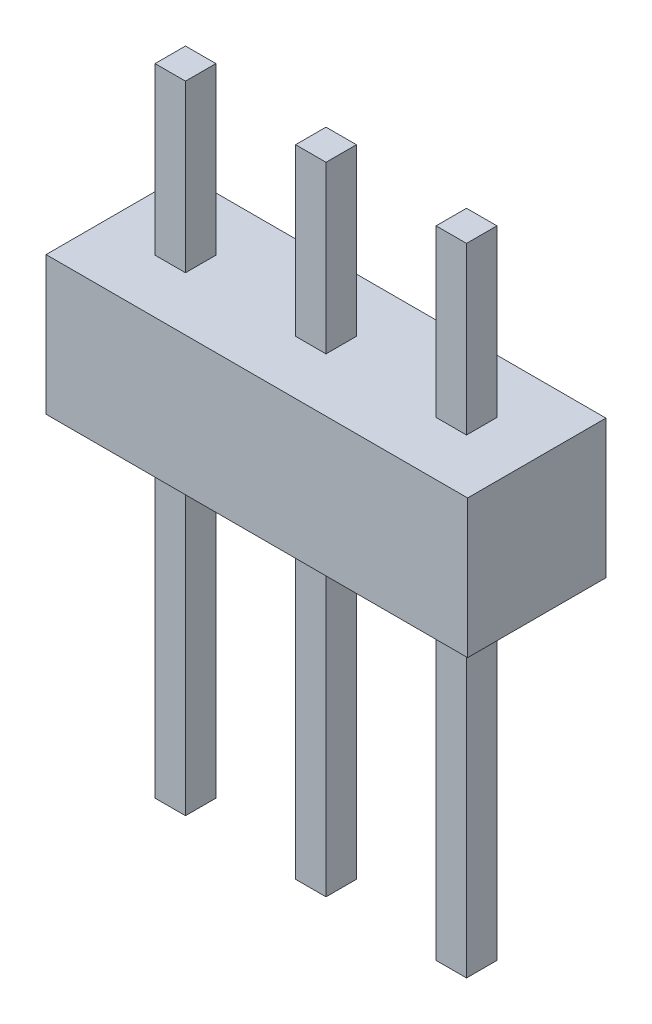
ISO-10303-21;
HEADER;
FILE_DESCRIPTION(('STEP AP214'),'2;1');
FILE_NAME('part.step','',(''),(''),'','','');
FILE_SCHEMA(('AUTOMOTIVE_DESIGN { 1 0 10303 214 1 1 1 1 }'));
ENDSEC;
DATA;
#1=APPLICATION_CONTEXT('core data for automotive mechanical design processes');
#2=APPLICATION_PROTOCOL_DEFINITION('international standard','automotive_design',2000,#1);
#3=PRODUCT_CONTEXT('',#1,'mechanical');
#4=PRODUCT('Part','Part','',(#3));
#5=PRODUCT_RELATED_PRODUCT_CATEGORY('part','',(#4));
#6=PRODUCT_DEFINITION_FORMATION('','',#4);
#7=PRODUCT_DEFINITION_CONTEXT('part definition',#1,'design');
#8=PRODUCT_DEFINITION('design','',#6,#7);
#9=PRODUCT_DEFINITION_SHAPE('','',#8);
#10=(LENGTH_UNIT() NAMED_UNIT(*) SI_UNIT(.MILLI.,.METRE.));
#11=(NAMED_UNIT(*) PLANE_ANGLE_UNIT() SI_UNIT($,.RADIAN.));
#12=(NAMED_UNIT(*) SI_UNIT($,.STERADIAN.) SOLID_ANGLE_UNIT());
#13=UNCERTAINTY_MEASURE_WITH_UNIT(LENGTH_MEASURE(1.E-05),#10,'distance_accuracy_value','');
#14=(GEOMETRIC_REPRESENTATION_CONTEXT(3) GLOBAL_UNCERTAINTY_ASSIGNED_CONTEXT((#13)) GLOBAL_UNIT_ASSIGNED_CONTEXT((#10,
#11,#12)) REPRESENTATION_CONTEXT('',''));
#15=CARTESIAN_POINT('',(0.,0.,0.));
#16=DIRECTION('',(0.,0.,1.));
#17=DIRECTION('',(1.,0.,0.));
#18=AXIS2_PLACEMENT_3D('',#15,#16,#17);
#19=CARTESIAN_POINT('',(6.625,5.5,-0.275));
#20=DIRECTION('',(1.,0.,0.));
#21=DIRECTION('',(0.,0.,-1.));
#22=AXIS2_PLACEMENT_3D('',#19,#20,#21);
#23=PLANE('',#22);
#24=DIRECTION('',(0.,0.,1.));
#25=VECTOR('',#24,1.);
#26=CARTESIAN_POINT('',(6.625,0.,-0.275));
#27=LINE('',#26,#25);
#28=CARTESIAN_POINT('',(6.625,0.,-0.275));
#29=VERTEX_POINT('',#28);
#30=CARTESIAN_POINT('',(6.625,0.,0.275));
#31=VERTEX_POINT('',#30);
#32=EDGE_CURVE('E107',#29,#31,#27,.T.);
#33=ORIENTED_EDGE('',*,*,#32,.F.);
#34=DIRECTION('',(0.,-1.,0.));
#35=VECTOR('',#34,1.);
#36=CARTESIAN_POINT('',(6.625,5.5,-0.275));
#37=LINE('',#36,#35);
#38=CARTESIAN_POINT('',(6.625,5.5,-0.275));
#39=VERTEX_POINT('',#38);
#40=EDGE_CURVE('E12',#39,#29,#37,.T.);
#41=ORIENTED_EDGE('',*,*,#40,.F.);
#42=DIRECTION('',(0.,0.,1.));
#43=VECTOR('',#42,1.);
#44=CARTESIAN_POINT('',(6.625,5.5,-0.275));
#45=LINE('',#44,#43);
#46=CARTESIAN_POINT('',(6.625,5.5,0.275));
#47=VERTEX_POINT('',#46);
#48=EDGE_CURVE('E101',#39,#47,#45,.T.);
#49=ORIENTED_EDGE('',*,*,#48,.T.);
#50=DIRECTION('',(0.,-1.,0.));
#51=VECTOR('',#50,1.);
#52=CARTESIAN_POINT('',(6.625,5.5,0.275));
#53=LINE('',#52,#51);
#54=EDGE_CURVE('E46',#47,#31,#53,.T.);
#55=ORIENTED_EDGE('',*,*,#54,.T.);
#56=EDGE_LOOP('',(#33,#41,#49,#55));
#57=FACE_BOUND('',#56,.T.);
#58=ADVANCED_FACE('F43',(#57),#23,.T.);
#59=CARTESIAN_POINT('',(6.075,5.5,-0.275));
#60=DIRECTION('',(0.,0.,-1.));
#61=DIRECTION('',(-1.,0.,0.));
#62=AXIS2_PLACEMENT_3D('',#59,#60,#61);
#63=PLANE('',#62);
#64=DIRECTION('',(1.,0.,0.));
#65=VECTOR('',#64,1.);
#66=CARTESIAN_POINT('',(6.075,0.,-0.275));
#67=LINE('',#66,#65);
#68=CARTESIAN_POINT('',(6.075,0.,-0.275));
#69=VERTEX_POINT('',#68);
#70=EDGE_CURVE('E103',#69,#29,#67,.T.);
#71=ORIENTED_EDGE('',*,*,#70,.F.);
#72=DIRECTION('',(0.,-1.,0.));
#73=VECTOR('',#72,1.);
#74=CARTESIAN_POINT('',(6.075,5.5,-0.275));
#75=LINE('',#74,#73);
#76=CARTESIAN_POINT('',(6.075,5.5,-0.275));
#77=VERTEX_POINT('',#76);
#78=EDGE_CURVE('E52',#77,#69,#75,.T.);
#79=ORIENTED_EDGE('',*,*,#78,.F.);
#80=DIRECTION('',(1.,0.,0.));
#81=VECTOR('',#80,1.);
#82=CARTESIAN_POINT('',(6.075,5.5,-0.275));
#83=LINE('',#82,#81);
#84=EDGE_CURVE('E98',#77,#39,#83,.T.);
#85=ORIENTED_EDGE('',*,*,#84,.T.);
#86=ORIENTED_EDGE('',*,*,#40,.T.);
#87=EDGE_LOOP('',(#71,#79,#85,#86));
#88=FACE_BOUND('',#87,.T.);
#89=ADVANCED_FACE('F117',(#88),#63,.T.);
#90=CARTESIAN_POINT('',(6.075,5.5,-0.275));
#91=DIRECTION('',(-1.,0.,0.));
#92=DIRECTION('',(0.,0.,1.));
#93=AXIS2_PLACEMENT_3D('',#90,#91,#92);
#94=PLANE('',#93);
#95=DIRECTION('',(0.,0.,-1.));
#96=VECTOR('',#95,1.);
#97=CARTESIAN_POINT('',(6.075,0.,-0.275));
#98=LINE('',#97,#96);
#99=CARTESIAN_POINT('',(6.075,0.,0.275));
#100=VERTEX_POINT('',#99);
#101=EDGE_CURVE('E93',#100,#69,#98,.T.);
#102=ORIENTED_EDGE('',*,*,#101,.F.);
#103=DIRECTION('',(0.,-1.,0.));
#104=VECTOR('',#103,1.);
#105=CARTESIAN_POINT('',(6.075,5.5,0.275));
#106=LINE('',#105,#104);
#107=CARTESIAN_POINT('',(6.075,5.5,0.275));
#108=VERTEX_POINT('',#107);
#109=EDGE_CURVE('E88',#108,#100,#106,.T.);
#110=ORIENTED_EDGE('',*,*,#109,.F.);
#111=DIRECTION('',(0.,0.,-1.));
#112=VECTOR('',#111,1.);
#113=CARTESIAN_POINT('',(6.075,5.5,-0.275));
#114=LINE('',#113,#112);
#115=EDGE_CURVE('E91',#108,#77,#114,.T.);
#116=ORIENTED_EDGE('',*,*,#115,.T.);
#117=ORIENTED_EDGE('',*,*,#78,.T.);
#118=EDGE_LOOP('',(#102,#110,#116,#117));
#119=FACE_BOUND('',#118,.T.);
#120=ADVANCED_FACE('F90',(#119),#94,.T.);
#121=CARTESIAN_POINT('',(6.075,5.5,0.275));
#122=DIRECTION('',(0.,0.,1.));
#123=DIRECTION('',(1.,0.,0.));
#124=AXIS2_PLACEMENT_3D('',#121,#122,#123);
#125=PLANE('',#124);
#126=DIRECTION('',(-1.,0.,0.));
#127=VECTOR('',#126,1.);
#128=CARTESIAN_POINT('',(6.075,0.,0.275));
#129=LINE('',#128,#127);
#130=EDGE_CURVE('E110',#31,#100,#129,.T.);
#131=ORIENTED_EDGE('',*,*,#130,.F.);
#132=ORIENTED_EDGE('',*,*,#54,.F.);
#133=DIRECTION('',(-1.,0.,0.));
#134=VECTOR('',#133,1.);
#135=CARTESIAN_POINT('',(6.075,5.5,0.275));
#136=LINE('',#135,#134);
#137=EDGE_CURVE('E97',#47,#108,#136,.T.);
#138=ORIENTED_EDGE('',*,*,#137,.T.);
#139=ORIENTED_EDGE('',*,*,#109,.T.);
#140=EDGE_LOOP('',(#131,#132,#138,#139));
#141=FACE_BOUND('',#140,.T.);
#142=ADVANCED_FACE('F100',(#141),#125,.T.);
#143=CARTESIAN_POINT('',(0.,5.5,0.));
#144=DIRECTION('',(0.,1.,0.));
#145=DIRECTION('',(0.,0.,1.));
#146=AXIS2_PLACEMENT_3D('',#143,#144,#145);
#147=PLANE('',#146);
#148=ORIENTED_EDGE('',*,*,#48,.F.);
#149=ORIENTED_EDGE('',*,*,#84,.F.);
#150=ORIENTED_EDGE('',*,*,#115,.F.);
#151=ORIENTED_EDGE('',*,*,#137,.F.);
#152=EDGE_LOOP('',(#148,#149,#150,#151));
#153=FACE_BOUND('',#152,.T.);
#154=ADVANCED_FACE('F96',(#153),#147,.T.);
#155=CARTESIAN_POINT('',(0.,0.,0.));
#156=DIRECTION('',(0.,1.,0.));
#157=DIRECTION('',(0.,0.,1.));
#158=AXIS2_PLACEMENT_3D('',#155,#156,#157);
#159=PLANE('',#158);
#160=ORIENTED_EDGE('',*,*,#32,.T.);
#161=ORIENTED_EDGE('',*,*,#130,.T.);
#162=ORIENTED_EDGE('',*,*,#101,.T.);
#163=ORIENTED_EDGE('',*,*,#70,.T.);
#164=EDGE_LOOP('',(#160,#161,#162,#163));
#165=FACE_BOUND('',#164,.T.);
#166=ADVANCED_FACE('F116',(#165),#159,.F.);
#167=CLOSED_SHELL('',(#58,#89,#120,#142,#154,#166));
#168=MANIFOLD_SOLID_BREP('B2',#167);
#169=CARTESIAN_POINT('',(4.085,5.5,-0.275));
#170=DIRECTION('',(1.,0.,0.));
#171=DIRECTION('',(0.,0.,-1.));
#172=AXIS2_PLACEMENT_3D('',#169,#170,#171);
#173=PLANE('',#172);
#174=DIRECTION('',(0.,0.,1.));
#175=VECTOR('',#174,1.);
#176=CARTESIAN_POINT('',(4.085,0.,-0.275));
#177=LINE('',#176,#175);
#178=CARTESIAN_POINT('',(4.085,0.,-0.275));
#179=VERTEX_POINT('',#178);
#180=CARTESIAN_POINT('',(4.085,0.,0.275));
#181=VERTEX_POINT('',#180);
#182=EDGE_CURVE('E240',#179,#181,#177,.T.);
#183=ORIENTED_EDGE('',*,*,#182,.F.);
#184=DIRECTION('',(0.,-1.,0.));
#185=VECTOR('',#184,1.);
#186=CARTESIAN_POINT('',(4.085,5.5,-0.275));
#187=LINE('',#186,#185);
#188=CARTESIAN_POINT('',(4.085,5.5,-0.275));
#189=VERTEX_POINT('',#188);
#190=EDGE_CURVE('E41',#189,#179,#187,.T.);
#191=ORIENTED_EDGE('',*,*,#190,.F.);
#192=DIRECTION('',(0.,0.,1.));
#193=VECTOR('',#192,1.);
#194=CARTESIAN_POINT('',(4.085,5.5,-0.275));
#195=LINE('',#194,#193);
#196=CARTESIAN_POINT('',(4.085,5.5,0.275));
#197=VERTEX_POINT('',#196);
#198=EDGE_CURVE('E234',#189,#197,#195,.T.);
#199=ORIENTED_EDGE('',*,*,#198,.T.);
#200=DIRECTION('',(0.,-1.,0.));
#201=VECTOR('',#200,1.);
#202=CARTESIAN_POINT('',(4.085,5.5,0.275));
#203=LINE('',#202,#201);
#204=EDGE_CURVE('E179',#197,#181,#203,.T.);
#205=ORIENTED_EDGE('',*,*,#204,.T.);
#206=EDGE_LOOP('',(#183,#191,#199,#205));
#207=FACE_BOUND('',#206,.T.);
#208=ADVANCED_FACE('F176',(#207),#173,.T.);
#209=CARTESIAN_POINT('',(3.535,5.5,-0.275));
#210=DIRECTION('',(0.,0.,-1.));
#211=DIRECTION('',(-1.,0.,0.));
#212=AXIS2_PLACEMENT_3D('',#209,#210,#211);
#213=PLANE('',#212);
#214=DIRECTION('',(1.,0.,0.));
#215=VECTOR('',#214,1.);
#216=CARTESIAN_POINT('',(3.535,0.,-0.275));
#217=LINE('',#216,#215);
#218=CARTESIAN_POINT('',(3.535,0.,-0.275));
#219=VERTEX_POINT('',#218);
#220=EDGE_CURVE('E236',#219,#179,#217,.T.);
#221=ORIENTED_EDGE('',*,*,#220,.F.);
#222=DIRECTION('',(0.,-1.,0.));
#223=VECTOR('',#222,1.);
#224=CARTESIAN_POINT('',(3.535,5.5,-0.275));
#225=LINE('',#224,#223);
#226=CARTESIAN_POINT('',(3.535,5.5,-0.275));
#227=VERTEX_POINT('',#226);
#228=EDGE_CURVE('E185',#227,#219,#225,.T.);
#229=ORIENTED_EDGE('',*,*,#228,.F.);
#230=DIRECTION('',(1.,0.,0.));
#231=VECTOR('',#230,1.);
#232=CARTESIAN_POINT('',(3.535,5.5,-0.275));
#233=LINE('',#232,#231);
#234=EDGE_CURVE('E231',#227,#189,#233,.T.);
#235=ORIENTED_EDGE('',*,*,#234,.T.);
#236=ORIENTED_EDGE('',*,*,#190,.T.);
#237=EDGE_LOOP('',(#221,#229,#235,#236));
#238=FACE_BOUND('',#237,.T.);
#239=ADVANCED_FACE('F250',(#238),#213,.T.);
#240=CARTESIAN_POINT('',(3.535,5.5,-0.275));
#241=DIRECTION('',(-1.,0.,0.));
#242=DIRECTION('',(0.,0.,1.));
#243=AXIS2_PLACEMENT_3D('',#240,#241,#242);
#244=PLANE('',#243);
#245=DIRECTION('',(0.,0.,-1.));
#246=VECTOR('',#245,1.);
#247=CARTESIAN_POINT('',(3.535,0.,-0.275));
#248=LINE('',#247,#246);
#249=CARTESIAN_POINT('',(3.535,0.,0.275));
#250=VERTEX_POINT('',#249);
#251=EDGE_CURVE('E226',#250,#219,#248,.T.);
#252=ORIENTED_EDGE('',*,*,#251,.F.);
#253=DIRECTION('',(0.,-1.,0.));
#254=VECTOR('',#253,1.);
#255=CARTESIAN_POINT('',(3.535,5.5,0.275));
#256=LINE('',#255,#254);
#257=CARTESIAN_POINT('',(3.535,5.5,0.275));
#258=VERTEX_POINT('',#257);
#259=EDGE_CURVE('E221',#258,#250,#256,.T.);
#260=ORIENTED_EDGE('',*,*,#259,.F.);
#261=DIRECTION('',(0.,0.,-1.));
#262=VECTOR('',#261,1.);
#263=CARTESIAN_POINT('',(3.535,5.5,-0.275));
#264=LINE('',#263,#262);
#265=EDGE_CURVE('E224',#258,#227,#264,.T.);
#266=ORIENTED_EDGE('',*,*,#265,.T.);
#267=ORIENTED_EDGE('',*,*,#228,.T.);
#268=EDGE_LOOP('',(#252,#260,#266,#267));
#269=FACE_BOUND('',#268,.T.);
#270=ADVANCED_FACE('F223',(#269),#244,.T.);
#271=CARTESIAN_POINT('',(3.535,5.5,0.275));
#272=DIRECTION('',(0.,0.,1.));
#273=DIRECTION('',(1.,0.,0.));
#274=AXIS2_PLACEMENT_3D('',#271,#272,#273);
#275=PLANE('',#274);
#276=DIRECTION('',(-1.,0.,0.));
#277=VECTOR('',#276,1.);
#278=CARTESIAN_POINT('',(3.535,0.,0.275));
#279=LINE('',#278,#277);
#280=EDGE_CURVE('E243',#181,#250,#279,.T.);
#281=ORIENTED_EDGE('',*,*,#280,.F.);
#282=ORIENTED_EDGE('',*,*,#204,.F.);
#283=DIRECTION('',(-1.,0.,0.));
#284=VECTOR('',#283,1.);
#285=CARTESIAN_POINT('',(3.535,5.5,0.275));
#286=LINE('',#285,#284);
#287=EDGE_CURVE('E230',#197,#258,#286,.T.);
#288=ORIENTED_EDGE('',*,*,#287,.T.);
#289=ORIENTED_EDGE('',*,*,#259,.T.);
#290=EDGE_LOOP('',(#281,#282,#288,#289));
#291=FACE_BOUND('',#290,.T.);
#292=ADVANCED_FACE('F233',(#291),#275,.T.);
#293=CARTESIAN_POINT('',(0.,5.5,0.));
#294=DIRECTION('',(0.,1.,0.));
#295=DIRECTION('',(0.,0.,1.));
#296=AXIS2_PLACEMENT_3D('',#293,#294,#295);
#297=PLANE('',#296);
#298=ORIENTED_EDGE('',*,*,#198,.F.);
#299=ORIENTED_EDGE('',*,*,#234,.F.);
#300=ORIENTED_EDGE('',*,*,#265,.F.);
#301=ORIENTED_EDGE('',*,*,#287,.F.);
#302=EDGE_LOOP('',(#298,#299,#300,#301));
#303=FACE_BOUND('',#302,.T.);
#304=ADVANCED_FACE('F229',(#303),#297,.T.);
#305=CARTESIAN_POINT('',(0.,0.,0.));
#306=DIRECTION('',(0.,1.,0.));
#307=DIRECTION('',(0.,0.,1.));
#308=AXIS2_PLACEMENT_3D('',#305,#306,#307);
#309=PLANE('',#308);
#310=ORIENTED_EDGE('',*,*,#182,.T.);
#311=ORIENTED_EDGE('',*,*,#280,.T.);
#312=ORIENTED_EDGE('',*,*,#251,.T.);
#313=ORIENTED_EDGE('',*,*,#220,.T.);
#314=EDGE_LOOP('',(#310,#311,#312,#313));
#315=FACE_BOUND('',#314,.T.);
#316=ADVANCED_FACE('F249',(#315),#309,.F.);
#317=CLOSED_SHELL('',(#208,#239,#270,#292,#304,#316));
#318=MANIFOLD_SOLID_BREP('B6',#317);
#319=CARTESIAN_POINT('',(1.545,5.5,-0.275));
#320=DIRECTION('',(1.,0.,0.));
#321=DIRECTION('',(0.,0.,-1.));
#322=AXIS2_PLACEMENT_3D('',#319,#320,#321);
#323=PLANE('',#322);
#324=DIRECTION('',(0.,0.,1.));
#325=VECTOR('',#324,1.);
#326=CARTESIAN_POINT('',(1.545,0.,-0.275));
#327=LINE('',#326,#325);
#328=CARTESIAN_POINT('',(1.545,0.,-0.275));
#329=VERTEX_POINT('',#328);
#330=CARTESIAN_POINT('',(1.545,0.,0.275));
#331=VERTEX_POINT('',#330);
#332=EDGE_CURVE('E373',#329,#331,#327,.T.);
#333=ORIENTED_EDGE('',*,*,#332,.F.);
#334=DIRECTION('',(0.,-1.,0.));
#335=VECTOR('',#334,1.);
#336=CARTESIAN_POINT('',(1.545,5.5,-0.275));
#337=LINE('',#336,#335);
#338=CARTESIAN_POINT('',(1.545,5.5,-0.275));
#339=VERTEX_POINT('',#338);
#340=EDGE_CURVE('E174',#339,#329,#337,.T.);
#341=ORIENTED_EDGE('',*,*,#340,.F.);
#342=DIRECTION('',(0.,0.,1.));
#343=VECTOR('',#342,1.);
#344=CARTESIAN_POINT('',(1.545,5.5,-0.275));
#345=LINE('',#344,#343);
#346=CARTESIAN_POINT('',(1.545,5.5,0.275));
#347=VERTEX_POINT('',#346);
#348=EDGE_CURVE('E367',#339,#347,#345,.T.);
#349=ORIENTED_EDGE('',*,*,#348,.T.);
#350=DIRECTION('',(0.,-1.,0.));
#351=VECTOR('',#350,1.);
#352=CARTESIAN_POINT('',(1.545,5.5,0.275));
#353=LINE('',#352,#351);
#354=EDGE_CURVE('E312',#347,#331,#353,.T.);
#355=ORIENTED_EDGE('',*,*,#354,.T.);
#356=EDGE_LOOP('',(#333,#341,#349,#355));
#357=FACE_BOUND('',#356,.T.);
#358=ADVANCED_FACE('F309',(#357),#323,.T.);
#359=CARTESIAN_POINT('',(0.995,5.5,-0.275));
#360=DIRECTION('',(0.,0.,-1.));
#361=DIRECTION('',(-1.,0.,0.));
#362=AXIS2_PLACEMENT_3D('',#359,#360,#361);
#363=PLANE('',#362);
#364=DIRECTION('',(1.,0.,0.));
#365=VECTOR('',#364,1.);
#366=CARTESIAN_POINT('',(0.995,0.,-0.275));
#367=LINE('',#366,#365);
#368=CARTESIAN_POINT('',(0.995,0.,-0.275));
#369=VERTEX_POINT('',#368);
#370=EDGE_CURVE('E369',#369,#329,#367,.T.);
#371=ORIENTED_EDGE('',*,*,#370,.F.);
#372=DIRECTION('',(0.,-1.,0.));
#373=VECTOR('',#372,1.);
#374=CARTESIAN_POINT('',(0.995,5.5,-0.275));
#375=LINE('',#374,#373);
#376=CARTESIAN_POINT('',(0.995,5.5,-0.275));
#377=VERTEX_POINT('',#376);
#378=EDGE_CURVE('E318',#377,#369,#375,.T.);
#379=ORIENTED_EDGE('',*,*,#378,.F.);
#380=DIRECTION('',(1.,0.,0.));
#381=VECTOR('',#380,1.);
#382=CARTESIAN_POINT('',(0.995,5.5,-0.275));
#383=LINE('',#382,#381);
#384=EDGE_CURVE('E364',#377,#339,#383,.T.);
#385=ORIENTED_EDGE('',*,*,#384,.T.);
#386=ORIENTED_EDGE('',*,*,#340,.T.);
#387=EDGE_LOOP('',(#371,#379,#385,#386));
#388=FACE_BOUND('',#387,.T.);
#389=ADVANCED_FACE('F383',(#388),#363,.T.);
#390=CARTESIAN_POINT('',(0.995,5.5,-0.275));
#391=DIRECTION('',(-1.,0.,0.));
#392=DIRECTION('',(0.,0.,1.));
#393=AXIS2_PLACEMENT_3D('',#390,#391,#392);
#394=PLANE('',#393);
#395=DIRECTION('',(0.,0.,-1.));
#396=VECTOR('',#395,1.);
#397=CARTESIAN_POINT('',(0.995,0.,-0.275));
#398=LINE('',#397,#396);
#399=CARTESIAN_POINT('',(0.995,0.,0.275));
#400=VERTEX_POINT('',#399);
#401=EDGE_CURVE('E359',#400,#369,#398,.T.);
#402=ORIENTED_EDGE('',*,*,#401,.F.);
#403=DIRECTION('',(0.,-1.,0.));
#404=VECTOR('',#403,1.);
#405=CARTESIAN_POINT('',(0.995,5.5,0.275));
#406=LINE('',#405,#404);
#407=CARTESIAN_POINT('',(0.995,5.5,0.275));
#408=VERTEX_POINT('',#407);
#409=EDGE_CURVE('E354',#408,#400,#406,.T.);
#410=ORIENTED_EDGE('',*,*,#409,.F.);
#411=DIRECTION('',(0.,0.,-1.));
#412=VECTOR('',#411,1.);
#413=CARTESIAN_POINT('',(0.995,5.5,-0.275));
#414=LINE('',#413,#412);
#415=EDGE_CURVE('E357',#408,#377,#414,.T.);
#416=ORIENTED_EDGE('',*,*,#415,.T.);
#417=ORIENTED_EDGE('',*,*,#378,.T.);
#418=EDGE_LOOP('',(#402,#410,#416,#417));
#419=FACE_BOUND('',#418,.T.);
#420=ADVANCED_FACE('F356',(#419),#394,.T.);
#421=CARTESIAN_POINT('',(0.995,5.5,0.275));
#422=DIRECTION('',(0.,0.,1.));
#423=DIRECTION('',(1.,0.,0.));
#424=AXIS2_PLACEMENT_3D('',#421,#422,#423);
#425=PLANE('',#424);
#426=DIRECTION('',(-1.,0.,0.));
#427=VECTOR('',#426,1.);
#428=CARTESIAN_POINT('',(0.995,0.,0.275));
#429=LINE('',#428,#427);
#430=EDGE_CURVE('E376',#331,#400,#429,.T.);
#431=ORIENTED_EDGE('',*,*,#430,.F.);
#432=ORIENTED_EDGE('',*,*,#354,.F.);
#433=DIRECTION('',(-1.,0.,0.));
#434=VECTOR('',#433,1.);
#435=CARTESIAN_POINT('',(0.995,5.5,0.275));
#436=LINE('',#435,#434);
#437=EDGE_CURVE('E363',#347,#408,#436,.T.);
#438=ORIENTED_EDGE('',*,*,#437,.T.);
#439=ORIENTED_EDGE('',*,*,#409,.T.);
#440=EDGE_LOOP('',(#431,#432,#438,#439));
#441=FACE_BOUND('',#440,.T.);
#442=ADVANCED_FACE('F366',(#441),#425,.T.);
#443=CARTESIAN_POINT('',(0.,5.5,0.));
#444=DIRECTION('',(0.,1.,0.));
#445=DIRECTION('',(0.,0.,1.));
#446=AXIS2_PLACEMENT_3D('',#443,#444,#445);
#447=PLANE('',#446);
#448=ORIENTED_EDGE('',*,*,#348,.F.);
#449=ORIENTED_EDGE('',*,*,#384,.F.);
#450=ORIENTED_EDGE('',*,*,#415,.F.);
#451=ORIENTED_EDGE('',*,*,#437,.F.);
#452=EDGE_LOOP('',(#448,#449,#450,#451));
#453=FACE_BOUND('',#452,.T.);
#454=ADVANCED_FACE('F362',(#453),#447,.T.);
#455=CARTESIAN_POINT('',(0.,0.,0.));
#456=DIRECTION('',(0.,1.,0.));
#457=DIRECTION('',(0.,0.,1.));
#458=AXIS2_PLACEMENT_3D('',#455,#456,#457);
#459=PLANE('',#458);
#460=ORIENTED_EDGE('',*,*,#332,.T.);
#461=ORIENTED_EDGE('',*,*,#430,.T.);
#462=ORIENTED_EDGE('',*,*,#401,.T.);
#463=ORIENTED_EDGE('',*,*,#370,.T.);
#464=EDGE_LOOP('',(#460,#461,#462,#463));
#465=FACE_BOUND('',#464,.T.);
#466=ADVANCED_FACE('F382',(#465),#459,.F.);
#467=CLOSED_SHELL('',(#358,#389,#420,#442,#454,#466));
#468=MANIFOLD_SOLID_BREP('B35',#467);
#469=CARTESIAN_POINT('',(6.625,-6.,-0.275));
#470=DIRECTION('',(-1.,0.,0.));
#471=DIRECTION('',(0.,0.,1.));
#472=AXIS2_PLACEMENT_3D('',#469,#470,#471);
#473=PLANE('',#472);
#474=DIRECTION('',(0.,0.,1.));
#475=VECTOR('',#474,1.);
#476=CARTESIAN_POINT('',(6.625,0.,-0.275));
#477=LINE('',#476,#475);
#478=CARTESIAN_POINT('',(6.625,0.,-0.275));
#479=VERTEX_POINT('',#478);
#480=CARTESIAN_POINT('',(6.625,0.,0.275));
#481=VERTEX_POINT('',#480);
#482=EDGE_CURVE('E505',#479,#481,#477,.T.);
#483=ORIENTED_EDGE('',*,*,#482,.T.);
#484=DIRECTION('',(0.,1.,0.));
#485=VECTOR('',#484,1.);
#486=CARTESIAN_POINT('',(6.625,-6.,0.275));
#487=LINE('',#486,#485);
#488=CARTESIAN_POINT('',(6.625,-6.,0.275));
#489=VERTEX_POINT('',#488);
#490=EDGE_CURVE('E307',#489,#481,#487,.T.);
#491=ORIENTED_EDGE('',*,*,#490,.F.);
#492=DIRECTION('',(0.,0.,1.));
#493=VECTOR('',#492,1.);
#494=CARTESIAN_POINT('',(6.625,-6.,-0.275));
#495=LINE('',#494,#493);
#496=CARTESIAN_POINT('',(6.625,-6.,-0.275));
#497=VERTEX_POINT('',#496);
#498=EDGE_CURVE('E493',#497,#489,#495,.T.);
#499=ORIENTED_EDGE('',*,*,#498,.F.);
#500=DIRECTION('',(0.,1.,0.));
#501=VECTOR('',#500,1.);
#502=CARTESIAN_POINT('',(6.625,-6.,-0.275));
#503=LINE('',#502,#501);
#504=EDGE_CURVE('E501',#497,#479,#503,.T.);
#505=ORIENTED_EDGE('',*,*,#504,.T.);
#506=EDGE_LOOP('',(#483,#491,#499,#505));
#507=FACE_BOUND('',#506,.T.);
#508=ADVANCED_FACE('F442',(#507),#473,.F.);
#509=CARTESIAN_POINT('',(6.075,-6.,0.275));
#510=DIRECTION('',(0.,0.,-1.));
#511=DIRECTION('',(-1.,0.,0.));
#512=AXIS2_PLACEMENT_3D('',#509,#510,#511);
#513=PLANE('',#512);
#514=DIRECTION('',(-1.,0.,0.));
#515=VECTOR('',#514,1.);
#516=CARTESIAN_POINT('',(6.075,0.,0.275));
#517=LINE('',#516,#515);
#518=CARTESIAN_POINT('',(6.075,0.,0.275));
#519=VERTEX_POINT('',#518);
#520=EDGE_CURVE('E497',#481,#519,#517,.T.);
#521=ORIENTED_EDGE('',*,*,#520,.T.);
#522=DIRECTION('',(0.,1.,0.));
#523=VECTOR('',#522,1.);
#524=CARTESIAN_POINT('',(6.075,-6.,0.275));
#525=LINE('',#524,#523);
#526=CARTESIAN_POINT('',(6.075,-6.,0.275));
#527=VERTEX_POINT('',#526);
#528=EDGE_CURVE('E450',#527,#519,#525,.T.);
#529=ORIENTED_EDGE('',*,*,#528,.F.);
#530=DIRECTION('',(-1.,0.,0.));
#531=VECTOR('',#530,1.);
#532=CARTESIAN_POINT('',(6.075,-6.,0.275));
#533=LINE('',#532,#531);
#534=EDGE_CURVE('E488',#489,#527,#533,.T.);
#535=ORIENTED_EDGE('',*,*,#534,.F.);
#536=ORIENTED_EDGE('',*,*,#490,.T.);
#537=EDGE_LOOP('',(#521,#529,#535,#536));
#538=FACE_BOUND('',#537,.T.);
#539=ADVANCED_FACE('F496',(#538),#513,.F.);
#540=CARTESIAN_POINT('',(6.075,-6.,-0.275));
#541=DIRECTION('',(1.,0.,0.));
#542=DIRECTION('',(0.,0.,-1.));
#543=AXIS2_PLACEMENT_3D('',#540,#541,#542);
#544=PLANE('',#543);
#545=DIRECTION('',(0.,0.,-1.));
#546=VECTOR('',#545,1.);
#547=CARTESIAN_POINT('',(6.075,0.,-0.275));
#548=LINE('',#547,#546);
#549=CARTESIAN_POINT('',(6.075,0.,-0.275));
#550=VERTEX_POINT('',#549);
#551=EDGE_CURVE('E475',#519,#550,#548,.T.);
#552=ORIENTED_EDGE('',*,*,#551,.T.);
#553=DIRECTION('',(0.,1.,0.));
#554=VECTOR('',#553,1.);
#555=CARTESIAN_POINT('',(6.075,-6.,-0.275));
#556=LINE('',#555,#554);
#557=CARTESIAN_POINT('',(6.075,-6.,-0.275));
#558=VERTEX_POINT('',#557);
#559=EDGE_CURVE('E498',#558,#550,#556,.T.);
#560=ORIENTED_EDGE('',*,*,#559,.F.);
#561=DIRECTION('',(0.,0.,-1.));
#562=VECTOR('',#561,1.);
#563=CARTESIAN_POINT('',(6.075,-6.,-0.275));
#564=LINE('',#563,#562);
#565=EDGE_CURVE('E491',#527,#558,#564,.T.);
#566=ORIENTED_EDGE('',*,*,#565,.F.);
#567=ORIENTED_EDGE('',*,*,#528,.T.);
#568=EDGE_LOOP('',(#552,#560,#566,#567));
#569=FACE_BOUND('',#568,.T.);
#570=ADVANCED_FACE('F499',(#569),#544,.F.);
#571=CARTESIAN_POINT('',(6.075,-6.,-0.275));
#572=DIRECTION('',(0.,0.,1.));
#573=DIRECTION('',(1.,0.,0.));
#574=AXIS2_PLACEMENT_3D('',#571,#572,#573);
#575=PLANE('',#574);
#576=DIRECTION('',(1.,0.,0.));
#577=VECTOR('',#576,1.);
#578=CARTESIAN_POINT('',(6.075,0.,-0.275));
#579=LINE('',#578,#577);
#580=EDGE_CURVE('E481',#550,#479,#579,.T.);
#581=ORIENTED_EDGE('',*,*,#580,.T.);
#582=ORIENTED_EDGE('',*,*,#504,.F.);
#583=DIRECTION('',(1.,0.,0.));
#584=VECTOR('',#583,1.);
#585=CARTESIAN_POINT('',(6.075,-6.,-0.275));
#586=LINE('',#585,#584);
#587=EDGE_CURVE('E458',#558,#497,#586,.T.);
#588=ORIENTED_EDGE('',*,*,#587,.F.);
#589=ORIENTED_EDGE('',*,*,#559,.T.);
#590=EDGE_LOOP('',(#581,#582,#588,#589));
#591=FACE_BOUND('',#590,.T.);
#592=ADVANCED_FACE('F512',(#591),#575,.F.);
#593=CARTESIAN_POINT('',(0.,-6.,0.));
#594=DIRECTION('',(0.,1.,0.));
#595=DIRECTION('',(0.,0.,1.));
#596=AXIS2_PLACEMENT_3D('',#593,#594,#595);
#597=PLANE('',#596);
#598=ORIENTED_EDGE('',*,*,#498,.T.);
#599=ORIENTED_EDGE('',*,*,#534,.T.);
#600=ORIENTED_EDGE('',*,*,#565,.T.);
#601=ORIENTED_EDGE('',*,*,#587,.T.);
#602=EDGE_LOOP('',(#598,#599,#600,#601));
#603=FACE_BOUND('',#602,.T.);
#604=ADVANCED_FACE('F489',(#603),#597,.F.);
#605=CARTESIAN_POINT('',(0.,0.,0.));
#606=DIRECTION('',(0.,1.,0.));
#607=DIRECTION('',(0.,0.,1.));
#608=AXIS2_PLACEMENT_3D('',#605,#606,#607);
#609=PLANE('',#608);
#610=ORIENTED_EDGE('',*,*,#482,.F.);
#611=ORIENTED_EDGE('',*,*,#580,.F.);
#612=ORIENTED_EDGE('',*,*,#551,.F.);
#613=ORIENTED_EDGE('',*,*,#520,.F.);
#614=EDGE_LOOP('',(#610,#611,#612,#613));
#615=FACE_BOUND('',#614,.T.);
#616=ADVANCED_FACE('F515',(#615),#609,.T.);
#617=CLOSED_SHELL('',(#508,#539,#570,#592,#604,#616));
#618=MANIFOLD_SOLID_BREP('B168',#617);
#619=CARTESIAN_POINT('',(4.085,-6.,-0.275));
#620=DIRECTION('',(-1.,0.,0.));
#621=DIRECTION('',(0.,0.,1.));
#622=AXIS2_PLACEMENT_3D('',#619,#620,#621);
#623=PLANE('',#622);
#624=DIRECTION('',(0.,0.,1.));
#625=VECTOR('',#624,1.);
#626=CARTESIAN_POINT('',(4.085,0.,-0.275));
#627=LINE('',#626,#625);
#628=CARTESIAN_POINT('',(4.085,0.,-0.275));
#629=VERTEX_POINT('',#628);
#630=CARTESIAN_POINT('',(4.085,0.,0.275));
#631=VERTEX_POINT('',#630);
#632=EDGE_CURVE('E638',#629,#631,#627,.T.);
#633=ORIENTED_EDGE('',*,*,#632,.T.);
#634=DIRECTION('',(0.,1.,0.));
#635=VECTOR('',#634,1.);
#636=CARTESIAN_POINT('',(4.085,-6.,0.275));
#637=LINE('',#636,#635);
#638=CARTESIAN_POINT('',(4.085,-6.,0.275));
#639=VERTEX_POINT('',#638);
#640=EDGE_CURVE('E440',#639,#631,#637,.T.);
#641=ORIENTED_EDGE('',*,*,#640,.F.);
#642=DIRECTION('',(0.,0.,1.));
#643=VECTOR('',#642,1.);
#644=CARTESIAN_POINT('',(4.085,-6.,-0.275));
#645=LINE('',#644,#643);
#646=CARTESIAN_POINT('',(4.085,-6.,-0.275));
#647=VERTEX_POINT('',#646);
#648=EDGE_CURVE('E626',#647,#639,#645,.T.);
#649=ORIENTED_EDGE('',*,*,#648,.F.);
#650=DIRECTION('',(0.,1.,0.));
#651=VECTOR('',#650,1.);
#652=CARTESIAN_POINT('',(4.085,-6.,-0.275));
#653=LINE('',#652,#651);
#654=EDGE_CURVE('E634',#647,#629,#653,.T.);
#655=ORIENTED_EDGE('',*,*,#654,.T.);
#656=EDGE_LOOP('',(#633,#641,#649,#655));
#657=FACE_BOUND('',#656,.T.);
#658=ADVANCED_FACE('F575',(#657),#623,.F.);
#659=CARTESIAN_POINT('',(3.535,-6.,0.275));
#660=DIRECTION('',(0.,0.,-1.));
#661=DIRECTION('',(-1.,0.,0.));
#662=AXIS2_PLACEMENT_3D('',#659,#660,#661);
#663=PLANE('',#662);
#664=DIRECTION('',(-1.,0.,0.));
#665=VECTOR('',#664,1.);
#666=CARTESIAN_POINT('',(3.535,0.,0.275));
#667=LINE('',#666,#665);
#668=CARTESIAN_POINT('',(3.535,0.,0.275));
#669=VERTEX_POINT('',#668);
#670=EDGE_CURVE('E630',#631,#669,#667,.T.);
#671=ORIENTED_EDGE('',*,*,#670,.T.);
#672=DIRECTION('',(0.,1.,0.));
#673=VECTOR('',#672,1.);
#674=CARTESIAN_POINT('',(3.535,-6.,0.275));
#675=LINE('',#674,#673);
#676=CARTESIAN_POINT('',(3.535,-6.,0.275));
#677=VERTEX_POINT('',#676);
#678=EDGE_CURVE('E583',#677,#669,#675,.T.);
#679=ORIENTED_EDGE('',*,*,#678,.F.);
#680=DIRECTION('',(-1.,0.,0.));
#681=VECTOR('',#680,1.);
#682=CARTESIAN_POINT('',(3.535,-6.,0.275));
#683=LINE('',#682,#681);
#684=EDGE_CURVE('E621',#639,#677,#683,.T.);
#685=ORIENTED_EDGE('',*,*,#684,.F.);
#686=ORIENTED_EDGE('',*,*,#640,.T.);
#687=EDGE_LOOP('',(#671,#679,#685,#686));
#688=FACE_BOUND('',#687,.T.);
#689=ADVANCED_FACE('F629',(#688),#663,.F.);
#690=CARTESIAN_POINT('',(3.535,-6.,-0.275));
#691=DIRECTION('',(1.,0.,0.));
#692=DIRECTION('',(0.,0.,-1.));
#693=AXIS2_PLACEMENT_3D('',#690,#691,#692);
#694=PLANE('',#693);
#695=DIRECTION('',(0.,0.,-1.));
#696=VECTOR('',#695,1.);
#697=CARTESIAN_POINT('',(3.535,0.,-0.275));
#698=LINE('',#697,#696);
#699=CARTESIAN_POINT('',(3.535,0.,-0.275));
#700=VERTEX_POINT('',#699);
#701=EDGE_CURVE('E608',#669,#700,#698,.T.);
#702=ORIENTED_EDGE('',*,*,#701,.T.);
#703=DIRECTION('',(0.,1.,0.));
#704=VECTOR('',#703,1.);
#705=CARTESIAN_POINT('',(3.535,-6.,-0.275));
#706=LINE('',#705,#704);
#707=CARTESIAN_POINT('',(3.535,-6.,-0.275));
#708=VERTEX_POINT('',#707);
#709=EDGE_CURVE('E631',#708,#700,#706,.T.);
#710=ORIENTED_EDGE('',*,*,#709,.F.);
#711=DIRECTION('',(0.,0.,-1.));
#712=VECTOR('',#711,1.);
#713=CARTESIAN_POINT('',(3.535,-6.,-0.275));
#714=LINE('',#713,#712);
#715=EDGE_CURVE('E624',#677,#708,#714,.T.);
#716=ORIENTED_EDGE('',*,*,#715,.F.);
#717=ORIENTED_EDGE('',*,*,#678,.T.);
#718=EDGE_LOOP('',(#702,#710,#716,#717));
#719=FACE_BOUND('',#718,.T.);
#720=ADVANCED_FACE('F632',(#719),#694,.F.);
#721=CARTESIAN_POINT('',(3.535,-6.,-0.275));
#722=DIRECTION('',(0.,0.,1.));
#723=DIRECTION('',(1.,0.,0.));
#724=AXIS2_PLACEMENT_3D('',#721,#722,#723);
#725=PLANE('',#724);
#726=DIRECTION('',(1.,0.,0.));
#727=VECTOR('',#726,1.);
#728=CARTESIAN_POINT('',(3.535,0.,-0.275));
#729=LINE('',#728,#727);
#730=EDGE_CURVE('E614',#700,#629,#729,.T.);
#731=ORIENTED_EDGE('',*,*,#730,.T.);
#732=ORIENTED_EDGE('',*,*,#654,.F.);
#733=DIRECTION('',(1.,0.,0.));
#734=VECTOR('',#733,1.);
#735=CARTESIAN_POINT('',(3.535,-6.,-0.275));
#736=LINE('',#735,#734);
#737=EDGE_CURVE('E591',#708,#647,#736,.T.);
#738=ORIENTED_EDGE('',*,*,#737,.F.);
#739=ORIENTED_EDGE('',*,*,#709,.T.);
#740=EDGE_LOOP('',(#731,#732,#738,#739));
#741=FACE_BOUND('',#740,.T.);
#742=ADVANCED_FACE('F645',(#741),#725,.F.);
#743=CARTESIAN_POINT('',(0.,-6.,0.));
#744=DIRECTION('',(0.,1.,0.));
#745=DIRECTION('',(0.,0.,1.));
#746=AXIS2_PLACEMENT_3D('',#743,#744,#745);
#747=PLANE('',#746);
#748=ORIENTED_EDGE('',*,*,#648,.T.);
#749=ORIENTED_EDGE('',*,*,#684,.T.);
#750=ORIENTED_EDGE('',*,*,#715,.T.);
#751=ORIENTED_EDGE('',*,*,#737,.T.);
#752=EDGE_LOOP('',(#748,#749,#750,#751));
#753=FACE_BOUND('',#752,.T.);
#754=ADVANCED_FACE('F622',(#753),#747,.F.);
#755=CARTESIAN_POINT('',(0.,0.,0.));
#756=DIRECTION('',(0.,1.,0.));
#757=DIRECTION('',(0.,0.,1.));
#758=AXIS2_PLACEMENT_3D('',#755,#756,#757);
#759=PLANE('',#758);
#760=ORIENTED_EDGE('',*,*,#632,.F.);
#761=ORIENTED_EDGE('',*,*,#730,.F.);
#762=ORIENTED_EDGE('',*,*,#701,.F.);
#763=ORIENTED_EDGE('',*,*,#670,.F.);
#764=EDGE_LOOP('',(#760,#761,#762,#763));
#765=FACE_BOUND('',#764,.T.);
#766=ADVANCED_FACE('F648',(#765),#759,.T.);
#767=CLOSED_SHELL('',(#658,#689,#720,#742,#754,#766));
#768=MANIFOLD_SOLID_BREP('B301',#767);
#769=CARTESIAN_POINT('',(1.545,-6.,-0.275));
#770=DIRECTION('',(-1.,0.,0.));
#771=DIRECTION('',(0.,0.,1.));
#772=AXIS2_PLACEMENT_3D('',#769,#770,#771);
#773=PLANE('',#772);
#774=DIRECTION('',(0.,0.,1.));
#775=VECTOR('',#774,1.);
#776=CARTESIAN_POINT('',(1.545,0.,-0.275));
#777=LINE('',#776,#775);
#778=CARTESIAN_POINT('',(1.545,0.,-0.275));
#779=VERTEX_POINT('',#778);
#780=CARTESIAN_POINT('',(1.545,0.,0.275));
#781=VERTEX_POINT('',#780);
#782=EDGE_CURVE('E770',#779,#781,#777,.T.);
#783=ORIENTED_EDGE('',*,*,#782,.T.);
#784=DIRECTION('',(0.,1.,0.));
#785=VECTOR('',#784,1.);
#786=CARTESIAN_POINT('',(1.545,-6.,0.275));
#787=LINE('',#786,#785);
#788=CARTESIAN_POINT('',(1.545,-6.,0.275));
#789=VERTEX_POINT('',#788);
#790=EDGE_CURVE('E573',#789,#781,#787,.T.);
#791=ORIENTED_EDGE('',*,*,#790,.F.);
#792=DIRECTION('',(0.,0.,1.));
#793=VECTOR('',#792,1.);
#794=CARTESIAN_POINT('',(1.545,-6.,-0.275));
#795=LINE('',#794,#793);
#796=CARTESIAN_POINT('',(1.545,-6.,-0.275));
#797=VERTEX_POINT('',#796);
#798=EDGE_CURVE('E758',#797,#789,#795,.T.);
#799=ORIENTED_EDGE('',*,*,#798,.F.);
#800=DIRECTION('',(0.,1.,0.));
#801=VECTOR('',#800,1.);
#802=CARTESIAN_POINT('',(1.545,-6.,-0.275));
#803=LINE('',#802,#801);
#804=EDGE_CURVE('E766',#797,#779,#803,.T.);
#805=ORIENTED_EDGE('',*,*,#804,.T.);
#806=EDGE_LOOP('',(#783,#791,#799,#805));
#807=FACE_BOUND('',#806,.T.);
#808=ADVANCED_FACE('F707',(#807),#773,.F.);
#809=CARTESIAN_POINT('',(0.995,-6.,0.275));
#810=DIRECTION('',(0.,0.,-1.));
#811=DIRECTION('',(-1.,0.,0.));
#812=AXIS2_PLACEMENT_3D('',#809,#810,#811);
#813=PLANE('',#812);
#814=DIRECTION('',(-1.,0.,0.));
#815=VECTOR('',#814,1.);
#816=CARTESIAN_POINT('',(0.995,0.,0.275));
#817=LINE('',#816,#815);
#818=CARTESIAN_POINT('',(0.995,0.,0.275));
#819=VERTEX_POINT('',#818);
#820=EDGE_CURVE('E762',#781,#819,#817,.T.);
#821=ORIENTED_EDGE('',*,*,#820,.T.);
#822=DIRECTION('',(0.,1.,0.));
#823=VECTOR('',#822,1.);
#824=CARTESIAN_POINT('',(0.995,-6.,0.275));
#825=LINE('',#824,#823);
#826=CARTESIAN_POINT('',(0.995,-6.,0.275));
#827=VERTEX_POINT('',#826);
#828=EDGE_CURVE('E715',#827,#819,#825,.T.);
#829=ORIENTED_EDGE('',*,*,#828,.F.);
#830=DIRECTION('',(-1.,0.,0.));
#831=VECTOR('',#830,1.);
#832=CARTESIAN_POINT('',(0.995,-6.,0.275));
#833=LINE('',#832,#831);
#834=EDGE_CURVE('E753',#789,#827,#833,.T.);
#835=ORIENTED_EDGE('',*,*,#834,.F.);
#836=ORIENTED_EDGE('',*,*,#790,.T.);
#837=EDGE_LOOP('',(#821,#829,#835,#836));
#838=FACE_BOUND('',#837,.T.);
#839=ADVANCED_FACE('F761',(#838),#813,.F.);
#840=CARTESIAN_POINT('',(0.995,-6.,-0.275));
#841=DIRECTION('',(1.,0.,0.));
#842=DIRECTION('',(0.,0.,-1.));
#843=AXIS2_PLACEMENT_3D('',#840,#841,#842);
#844=PLANE('',#843);
#845=DIRECTION('',(0.,0.,-1.));
#846=VECTOR('',#845,1.);
#847=CARTESIAN_POINT('',(0.995,0.,-0.275));
#848=LINE('',#847,#846);
#849=CARTESIAN_POINT('',(0.995,0.,-0.275));
#850=VERTEX_POINT('',#849);
#851=EDGE_CURVE('E740',#819,#850,#848,.T.);
#852=ORIENTED_EDGE('',*,*,#851,.T.);
#853=DIRECTION('',(0.,1.,0.));
#854=VECTOR('',#853,1.);
#855=CARTESIAN_POINT('',(0.995,-6.,-0.275));
#856=LINE('',#855,#854);
#857=CARTESIAN_POINT('',(0.995,-6.,-0.275));
#858=VERTEX_POINT('',#857);
#859=EDGE_CURVE('E763',#858,#850,#856,.T.);
#860=ORIENTED_EDGE('',*,*,#859,.F.);
#861=DIRECTION('',(0.,0.,-1.));
#862=VECTOR('',#861,1.);
#863=CARTESIAN_POINT('',(0.995,-6.,-0.275));
#864=LINE('',#863,#862);
#865=EDGE_CURVE('E756',#827,#858,#864,.T.);
#866=ORIENTED_EDGE('',*,*,#865,.F.);
#867=ORIENTED_EDGE('',*,*,#828,.T.);
#868=EDGE_LOOP('',(#852,#860,#866,#867));
#869=FACE_BOUND('',#868,.T.);
#870=ADVANCED_FACE('F764',(#869),#844,.F.);
#871=CARTESIAN_POINT('',(0.995,-6.,-0.275));
#872=DIRECTION('',(0.,0.,1.));
#873=DIRECTION('',(1.,0.,0.));
#874=AXIS2_PLACEMENT_3D('',#871,#872,#873);
#875=PLANE('',#874);
#876=DIRECTION('',(1.,0.,0.));
#877=VECTOR('',#876,1.);
#878=CARTESIAN_POINT('',(0.995,0.,-0.275));
#879=LINE('',#878,#877);
#880=EDGE_CURVE('E746',#850,#779,#879,.T.);
#881=ORIENTED_EDGE('',*,*,#880,.T.);
#882=ORIENTED_EDGE('',*,*,#804,.F.);
#883=DIRECTION('',(1.,0.,0.));
#884=VECTOR('',#883,1.);
#885=CARTESIAN_POINT('',(0.995,-6.,-0.275));
#886=LINE('',#885,#884);
#887=EDGE_CURVE('E723',#858,#797,#886,.T.);
#888=ORIENTED_EDGE('',*,*,#887,.F.);
#889=ORIENTED_EDGE('',*,*,#859,.T.);
#890=EDGE_LOOP('',(#881,#882,#888,#889));
#891=FACE_BOUND('',#890,.T.);
#892=ADVANCED_FACE('F777',(#891),#875,.F.);
#893=CARTESIAN_POINT('',(0.,-6.,0.));
#894=DIRECTION('',(0.,1.,0.));
#895=DIRECTION('',(0.,0.,1.));
#896=AXIS2_PLACEMENT_3D('',#893,#894,#895);
#897=PLANE('',#896);
#898=ORIENTED_EDGE('',*,*,#798,.T.);
#899=ORIENTED_EDGE('',*,*,#834,.T.);
#900=ORIENTED_EDGE('',*,*,#865,.T.);
#901=ORIENTED_EDGE('',*,*,#887,.T.);
#902=EDGE_LOOP('',(#898,#899,#900,#901));
#903=FACE_BOUND('',#902,.T.);
#904=ADVANCED_FACE('F754',(#903),#897,.F.);
#905=CARTESIAN_POINT('',(0.,0.,0.));
#906=DIRECTION('',(0.,1.,0.));
#907=DIRECTION('',(0.,0.,1.));
#908=AXIS2_PLACEMENT_3D('',#905,#906,#907);
#909=PLANE('',#908);
#910=ORIENTED_EDGE('',*,*,#782,.F.);
#911=ORIENTED_EDGE('',*,*,#880,.F.);
#912=ORIENTED_EDGE('',*,*,#851,.F.);
#913=ORIENTED_EDGE('',*,*,#820,.F.);
#914=EDGE_LOOP('',(#910,#911,#912,#913));
#915=FACE_BOUND('',#914,.T.);
#916=ADVANCED_FACE('F780',(#915),#909,.T.);
#917=CLOSED_SHELL('',(#808,#839,#870,#892,#904,#916));
#918=MANIFOLD_SOLID_BREP('B434',#917);
#919=CARTESIAN_POINT('',(0.,0.,1.25));
#920=DIRECTION('',(1.,0.,0.));
#921=DIRECTION('',(0.,0.,-1.));
#922=AXIS2_PLACEMENT_3D('',#919,#920,#921);
#923=PLANE('',#922);
#924=DIRECTION('',(0.,-1.,0.));
#925=VECTOR('',#924,1.);
#926=CARTESIAN_POINT('',(0.,0.,-1.25));
#927=LINE('',#926,#925);
#928=CARTESIAN_POINT('',(0.,2.5,-1.25));
#929=VERTEX_POINT('',#928);
#930=CARTESIAN_POINT('',(0.,0.,-1.25));
#931=VERTEX_POINT('',#930);
#932=EDGE_CURVE('E893',#929,#931,#927,.T.);
#933=ORIENTED_EDGE('',*,*,#932,.T.);
#934=DIRECTION('',(0.,0.,-1.));
#935=VECTOR('',#934,1.);
#936=CARTESIAN_POINT('',(0.,0.,1.25));
#937=LINE('',#936,#935);
#938=CARTESIAN_POINT('',(0.,0.,1.25));
#939=VERTEX_POINT('',#938);
#940=EDGE_CURVE('E705',#939,#931,#937,.T.);
#941=ORIENTED_EDGE('',*,*,#940,.F.);
#942=DIRECTION('',(0.,-1.,0.));
#943=VECTOR('',#942,1.);
#944=CARTESIAN_POINT('',(0.,0.,1.25));
#945=LINE('',#944,#943);
#946=CARTESIAN_POINT('',(0.,2.5,1.25));
#947=VERTEX_POINT('',#946);
#948=EDGE_CURVE('E881',#947,#939,#945,.T.);
#949=ORIENTED_EDGE('',*,*,#948,.F.);
#950=DIRECTION('',(0.,0.,-1.));
#951=VECTOR('',#950,1.);
#952=CARTESIAN_POINT('',(0.,2.5,1.25));
#953=LINE('',#952,#951);
#954=EDGE_CURVE('E889',#947,#929,#953,.T.);
#955=ORIENTED_EDGE('',*,*,#954,.T.);
#956=EDGE_LOOP('',(#933,#941,#949,#955));
#957=FACE_BOUND('',#956,.T.);
#958=ADVANCED_FACE('F830',(#957),#923,.F.);
#959=CARTESIAN_POINT('',(0.,0.,1.25));
#960=DIRECTION('',(0.,1.,0.));
#961=DIRECTION('',(0.,0.,1.));
#962=AXIS2_PLACEMENT_3D('',#959,#960,#961);
#963=PLANE('',#962);
#964=DIRECTION('',(1.,0.,0.));
#965=VECTOR('',#964,1.);
#966=CARTESIAN_POINT('',(0.,0.,-1.25));
#967=LINE('',#966,#965);
#968=CARTESIAN_POINT('',(7.62,0.,-1.25));
#969=VERTEX_POINT('',#968);
#970=EDGE_CURVE('E885',#931,#969,#967,.T.);
#971=ORIENTED_EDGE('',*,*,#970,.T.);
#972=DIRECTION('',(0.,0.,-1.));
#973=VECTOR('',#972,1.);
#974=CARTESIAN_POINT('',(7.62,0.,1.25));
#975=LINE('',#974,#973);
#976=CARTESIAN_POINT('',(7.62,0.,1.25));
#977=VERTEX_POINT('',#976);
#978=EDGE_CURVE('E838',#977,#969,#975,.T.);
#979=ORIENTED_EDGE('',*,*,#978,.F.);
#980=DIRECTION('',(1.,0.,0.));
#981=VECTOR('',#980,1.);
#982=CARTESIAN_POINT('',(0.,0.,1.25));
#983=LINE('',#982,#981);
#984=EDGE_CURVE('E876',#939,#977,#983,.T.);
#985=ORIENTED_EDGE('',*,*,#984,.F.);
#986=ORIENTED_EDGE('',*,*,#940,.T.);
#987=EDGE_LOOP('',(#971,#979,#985,#986));
#988=FACE_BOUND('',#987,.T.);
#989=ADVANCED_FACE('F884',(#988),#963,.F.);
#990=CARTESIAN_POINT('',(7.62,0.,1.25));
#991=DIRECTION('',(-1.,0.,0.));
#992=DIRECTION('',(0.,0.,1.));
#993=AXIS2_PLACEMENT_3D('',#990,#991,#992);
#994=PLANE('',#993);
#995=DIRECTION('',(0.,1.,0.));
#996=VECTOR('',#995,1.);
#997=CARTESIAN_POINT('',(7.62,0.,-1.25));
#998=LINE('',#997,#996);
#999=CARTESIAN_POINT('',(7.62,2.5,-1.25));
#1000=VERTEX_POINT('',#999);
#1001=EDGE_CURVE('E863',#969,#1000,#998,.T.);
#1002=ORIENTED_EDGE('',*,*,#1001,.T.);
#1003=DIRECTION('',(0.,0.,-1.));
#1004=VECTOR('',#1003,1.);
#1005=CARTESIAN_POINT('',(7.62,2.5,1.25));
#1006=LINE('',#1005,#1004);
#1007=CARTESIAN_POINT('',(7.62,2.5,1.25));
#1008=VERTEX_POINT('',#1007);
#1009=EDGE_CURVE('E886',#1008,#1000,#1006,.T.);
#1010=ORIENTED_EDGE('',*,*,#1009,.F.);
#1011=DIRECTION('',(0.,1.,0.));
#1012=VECTOR('',#1011,1.);
#1013=CARTESIAN_POINT('',(7.62,0.,1.25));
#1014=LINE('',#1013,#1012);
#1015=EDGE_CURVE('E879',#977,#1008,#1014,.T.);
#1016=ORIENTED_EDGE('',*,*,#1015,.F.);
#1017=ORIENTED_EDGE('',*,*,#978,.T.);
#1018=EDGE_LOOP('',(#1002,#1010,#1016,#1017));
#1019=FACE_BOUND('',#1018,.T.);
#1020=ADVANCED_FACE('F887',(#1019),#994,.F.);
#1021=CARTESIAN_POINT('',(0.,2.5,1.25));
#1022=DIRECTION('',(0.,-1.,0.));
#1023=DIRECTION('',(1.,0.,0.));
#1024=AXIS2_PLACEMENT_3D('',#1021,#1022,#1023);
#1025=PLANE('',#1024);
#1026=DIRECTION('',(-1.,0.,0.));
#1027=VECTOR('',#1026,1.);
#1028=CARTESIAN_POINT('',(0.,2.5,-1.25));
#1029=LINE('',#1028,#1027);
#1030=EDGE_CURVE('E869',#1000,#929,#1029,.T.);
#1031=ORIENTED_EDGE('',*,*,#1030,.T.);
#1032=ORIENTED_EDGE('',*,*,#954,.F.);
#1033=DIRECTION('',(-1.,0.,0.));
#1034=VECTOR('',#1033,1.);
#1035=CARTESIAN_POINT('',(0.,2.5,1.25));
#1036=LINE('',#1035,#1034);
#1037=EDGE_CURVE('E846',#1008,#947,#1036,.T.);
#1038=ORIENTED_EDGE('',*,*,#1037,.F.);
#1039=ORIENTED_EDGE('',*,*,#1009,.T.);
#1040=EDGE_LOOP('',(#1031,#1032,#1038,#1039));
#1041=FACE_BOUND('',#1040,.T.);
#1042=ADVANCED_FACE('F900',(#1041),#1025,.F.);
#1043=CARTESIAN_POINT('',(0.,0.,1.25));
#1044=DIRECTION('',(0.,0.,-1.));
#1045=DIRECTION('',(-1.,0.,0.));
#1046=AXIS2_PLACEMENT_3D('',#1043,#1044,#1045);
#1047=PLANE('',#1046);
#1048=ORIENTED_EDGE('',*,*,#948,.T.);
#1049=ORIENTED_EDGE('',*,*,#984,.T.);
#1050=ORIENTED_EDGE('',*,*,#1015,.T.);
#1051=ORIENTED_EDGE('',*,*,#1037,.T.);
#1052=EDGE_LOOP('',(#1048,#1049,#1050,#1051));
#1053=FACE_BOUND('',#1052,.T.);
#1054=ADVANCED_FACE('F877',(#1053),#1047,.F.);
#1055=CARTESIAN_POINT('',(0.,0.,-1.25));
#1056=DIRECTION('',(0.,0.,-1.));
#1057=DIRECTION('',(-1.,0.,0.));
#1058=AXIS2_PLACEMENT_3D('',#1055,#1056,#1057);
#1059=PLANE('',#1058);
#1060=ORIENTED_EDGE('',*,*,#932,.F.);
#1061=ORIENTED_EDGE('',*,*,#1030,.F.);
#1062=ORIENTED_EDGE('',*,*,#1001,.F.);
#1063=ORIENTED_EDGE('',*,*,#970,.F.);
#1064=EDGE_LOOP('',(#1060,#1061,#1062,#1063));
#1065=FACE_BOUND('',#1064,.T.);
#1066=ADVANCED_FACE('F903',(#1065),#1059,.T.);
#1067=CLOSED_SHELL('',(#958,#989,#1020,#1042,#1054,#1066));
#1068=MANIFOLD_SOLID_BREP('B567',#1067);
#1069=ADVANCED_BREP_SHAPE_REPRESENTATION('',(#18,#168,#318,#468,#618,#768,#918,#1068),#14);
#1070=SHAPE_DEFINITION_REPRESENTATION(#9,#1069);
ENDSEC;
END-ISO-10303-21;
